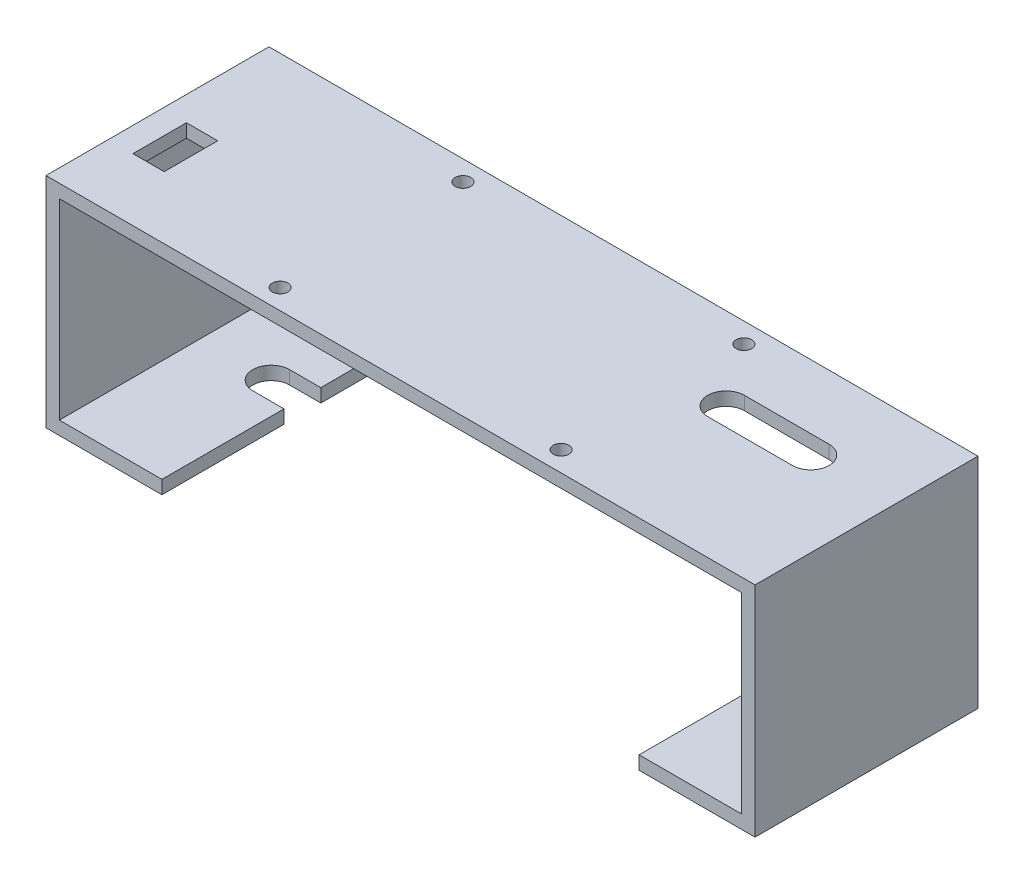
ISO-10303-21;
HEADER;
FILE_DESCRIPTION(('STEP AP214'),'2;1');
FILE_NAME('part.step','',(''),(''),'','','');
FILE_SCHEMA(('AUTOMOTIVE_DESIGN { 1 0 10303 214 1 1 1 1 }'));
ENDSEC;
DATA;
#1=APPLICATION_CONTEXT('core data for automotive mechanical design processes');
#2=APPLICATION_PROTOCOL_DEFINITION('international standard','automotive_design',2000,#1);
#3=PRODUCT_CONTEXT('',#1,'mechanical');
#4=PRODUCT('Part','Part','',(#3));
#5=PRODUCT_RELATED_PRODUCT_CATEGORY('part','',(#4));
#6=PRODUCT_DEFINITION_FORMATION('','',#4);
#7=PRODUCT_DEFINITION_CONTEXT('part definition',#1,'design');
#8=PRODUCT_DEFINITION('design','',#6,#7);
#9=PRODUCT_DEFINITION_SHAPE('','',#8);
#10=(LENGTH_UNIT() NAMED_UNIT(*) SI_UNIT(.MILLI.,.METRE.));
#11=(NAMED_UNIT(*) PLANE_ANGLE_UNIT() SI_UNIT($,.RADIAN.));
#12=(NAMED_UNIT(*) SI_UNIT($,.STERADIAN.) SOLID_ANGLE_UNIT());
#13=UNCERTAINTY_MEASURE_WITH_UNIT(LENGTH_MEASURE(1.E-05),#10,'distance_accuracy_value','');
#14=(GEOMETRIC_REPRESENTATION_CONTEXT(3) GLOBAL_UNCERTAINTY_ASSIGNED_CONTEXT((#13)) GLOBAL_UNIT_ASSIGNED_CONTEXT((#10,
#11,#12)) REPRESENTATION_CONTEXT('',''));
#15=CARTESIAN_POINT('',(0.,0.,0.));
#16=DIRECTION('',(0.,0.,1.));
#17=DIRECTION('',(1.,0.,0.));
#18=AXIS2_PLACEMENT_3D('',#15,#16,#17);
#19=CARTESIAN_POINT('',(0.,0.,0.));
#20=DIRECTION('',(0.,1.,0.));
#21=DIRECTION('',(0.,0.,1.));
#22=AXIS2_PLACEMENT_3D('',#19,#20,#21);
#23=PLANE('',#22);
#24=CARTESIAN_POINT('',(31.5,0.,20.5));
#25=DIRECTION('',(0.,1.,0.));
#26=DIRECTION('',(0.,0.,1.));
#27=AXIS2_PLACEMENT_3D('',#24,#25,#26);
#28=CIRCLE('',#27,1.75);
#29=CARTESIAN_POINT('',(31.5,0.,22.25));
#30=VERTEX_POINT('',#29);
#31=EDGE_CURVE('E611',#30,#30,#28,.T.);
#32=ORIENTED_EDGE('',*,*,#31,.T.);
#33=EDGE_LOOP('',(#32));
#34=FACE_BOUND('',#33,.T.);
#35=CARTESIAN_POINT('',(-31.5,0.,-20.5));
#36=DIRECTION('',(0.,1.,0.));
#37=DIRECTION('',(0.,0.,1.));
#38=AXIS2_PLACEMENT_3D('',#35,#36,#37);
#39=CIRCLE('',#38,1.75);
#40=CARTESIAN_POINT('',(-31.5,0.,-18.75));
#41=VERTEX_POINT('',#40);
#42=EDGE_CURVE('E622',#41,#41,#39,.T.);
#43=ORIENTED_EDGE('',*,*,#42,.T.);
#44=EDGE_LOOP('',(#43));
#45=FACE_BOUND('',#44,.T.);
#46=DIRECTION('',(-1.,0.,0.));
#47=VECTOR('',#46,1.);
#48=CARTESIAN_POINT('',(-74.,0.,11.));
#49=LINE('',#48,#47);
#50=CARTESIAN_POINT('',(-67.,0.,11.));
#51=VERTEX_POINT('',#50);
#52=CARTESIAN_POINT('',(-74.,0.,11.));
#53=VERTEX_POINT('',#52);
#54=EDGE_CURVE('E224',#51,#53,#49,.T.);
#55=ORIENTED_EDGE('',*,*,#54,.F.);
#56=DIRECTION('',(0.,0.,1.));
#57=VECTOR('',#56,1.);
#58=CARTESIAN_POINT('',(-67.,0.,-0.999999999999994));
#59=LINE('',#58,#57);
#60=CARTESIAN_POINT('',(-67.,0.,-0.999999999999994));
#61=VERTEX_POINT('',#60);
#62=EDGE_CURVE('E231',#61,#51,#59,.T.);
#63=ORIENTED_EDGE('',*,*,#62,.F.);
#64=DIRECTION('',(1.,0.,0.));
#65=VECTOR('',#64,1.);
#66=CARTESIAN_POINT('',(-74.,0.,-0.999999999999994));
#67=LINE('',#66,#65);
#68=CARTESIAN_POINT('',(-74.,0.,-0.999999999999994));
#69=VERTEX_POINT('',#68);
#70=EDGE_CURVE('E236',#69,#61,#67,.T.);
#71=ORIENTED_EDGE('',*,*,#70,.F.);
#72=DIRECTION('',(0.,0.,-1.));
#73=VECTOR('',#72,1.);
#74=CARTESIAN_POINT('',(-74.,0.,-0.999999999999994));
#75=LINE('',#74,#73);
#76=EDGE_CURVE('E51',#53,#69,#75,.T.);
#77=ORIENTED_EDGE('',*,*,#76,.F.);
#78=EDGE_LOOP('',(#55,#63,#71,#77));
#79=FACE_BOUND('',#78,.T.);
#80=DIRECTION('',(1.,0.,0.));
#81=VECTOR('',#80,1.);
#82=CARTESIAN_POINT('',(41.5,0.,-10.625));
#83=LINE('',#82,#81);
#84=CARTESIAN_POINT('',(41.5,0.,-10.625));
#85=VERTEX_POINT('',#84);
#86=CARTESIAN_POINT('',(60.5,0.,-10.625));
#87=VERTEX_POINT('',#86);
#88=EDGE_CURVE('E290',#85,#87,#83,.T.);
#89=ORIENTED_EDGE('',*,*,#88,.F.);
#90=CARTESIAN_POINT('',(41.5,0.,-6.49999999999999));
#91=DIRECTION('',(0.,-1.,0.));
#92=DIRECTION('',(0.,0.,-1.));
#93=AXIS2_PLACEMENT_3D('',#90,#91,#92);
#94=CIRCLE('',#93,4.125);
#95=CARTESIAN_POINT('',(41.5,0.,-2.37499999999999));
#96=VERTEX_POINT('',#95);
#97=EDGE_CURVE('E288',#96,#85,#94,.T.);
#98=ORIENTED_EDGE('',*,*,#97,.F.);
#99=DIRECTION('',(-1.,0.,0.));
#100=VECTOR('',#99,1.);
#101=CARTESIAN_POINT('',(41.5,0.,-2.37499999999999));
#102=LINE('',#101,#100);
#103=CARTESIAN_POINT('',(60.5,0.,-2.37499999999999));
#104=VERTEX_POINT('',#103);
#105=EDGE_CURVE('E296',#104,#96,#102,.T.);
#106=ORIENTED_EDGE('',*,*,#105,.F.);
#107=CARTESIAN_POINT('',(60.5,0.,-6.49999999999999));
#108=DIRECTION('',(0.,-1.,0.));
#109=DIRECTION('',(0.,0.,-1.));
#110=AXIS2_PLACEMENT_3D('',#107,#108,#109);
#111=CIRCLE('',#110,4.125);
#112=EDGE_CURVE('E293',#87,#104,#111,.T.);
#113=ORIENTED_EDGE('',*,*,#112,.F.);
#114=EDGE_LOOP('',(#89,#98,#106,#113));
#115=FACE_BOUND('',#114,.T.);
#116=DIRECTION('',(0.,0.,-1.));
#117=VECTOR('',#116,1.);
#118=CARTESIAN_POINT('',(76.5,0.,77.8393792544916));
#119=LINE('',#118,#117);
#120=CARTESIAN_POINT('',(76.5,0.,25.));
#121=VERTEX_POINT('',#120);
#122=CARTESIAN_POINT('',(76.5,0.,-25.));
#123=VERTEX_POINT('',#122);
#124=EDGE_CURVE('E342',#121,#123,#119,.T.);
#125=ORIENTED_EDGE('',*,*,#124,.F.);
#126=DIRECTION('',(1.,0.,0.));
#127=VECTOR('',#126,1.);
#128=CARTESIAN_POINT('',(-52.5,0.,25.));
#129=LINE('',#128,#127);
#130=CARTESIAN_POINT('',(-76.5,0.,25.));
#131=VERTEX_POINT('',#130);
#132=EDGE_CURVE('E417',#131,#121,#129,.T.);
#133=ORIENTED_EDGE('',*,*,#132,.F.);
#134=DIRECTION('',(0.,0.,-1.));
#135=VECTOR('',#134,1.);
#136=CARTESIAN_POINT('',(-76.5,0.,77.8393792544916));
#137=LINE('',#136,#135);
#138=CARTESIAN_POINT('',(-76.5,0.,-25.));
#139=VERTEX_POINT('',#138);
#140=EDGE_CURVE('E389',#131,#139,#137,.T.);
#141=ORIENTED_EDGE('',*,*,#140,.T.);
#142=DIRECTION('',(-1.,0.,0.));
#143=VECTOR('',#142,1.);
#144=CARTESIAN_POINT('',(-79.5,0.,-25.));
#145=LINE('',#144,#143);
#146=EDGE_CURVE('E37',#123,#139,#145,.T.);
#147=ORIENTED_EDGE('',*,*,#146,.F.);
#148=EDGE_LOOP('',(#125,#133,#141,#147));
#149=FACE_BOUND('',#148,.T.);
#150=CARTESIAN_POINT('',(-31.5,0.,20.5));
#151=DIRECTION('',(0.,1.,0.));
#152=DIRECTION('',(0.,0.,1.));
#153=AXIS2_PLACEMENT_3D('',#150,#151,#152);
#154=CIRCLE('',#153,1.75);
#155=CARTESIAN_POINT('',(-31.5,0.,22.25));
#156=VERTEX_POINT('',#155);
#157=EDGE_CURVE('E619',#156,#156,#154,.T.);
#158=ORIENTED_EDGE('',*,*,#157,.T.);
#159=EDGE_LOOP('',(#158));
#160=FACE_BOUND('',#159,.T.);
#161=CARTESIAN_POINT('',(31.5,0.,-20.5));
#162=DIRECTION('',(0.,1.,0.));
#163=DIRECTION('',(0.,0.,1.));
#164=AXIS2_PLACEMENT_3D('',#161,#162,#163);
#165=CIRCLE('',#164,1.75);
#166=CARTESIAN_POINT('',(31.5,0.,-18.75));
#167=VERTEX_POINT('',#166);
#168=EDGE_CURVE('E606',#167,#167,#165,.T.);
#169=ORIENTED_EDGE('',*,*,#168,.T.);
#170=EDGE_LOOP('',(#169));
#171=FACE_BOUND('',#170,.T.);
#172=ADVANCED_FACE('F33',(#34,#45,#79,#115,#149,#160,#171),#23,.F.);
#173=CARTESIAN_POINT('',(0.,3.,0.));
#174=DIRECTION('',(0.,1.,0.));
#175=DIRECTION('',(0.,0.,1.));
#176=AXIS2_PLACEMENT_3D('',#173,#174,#175);
#177=PLANE('',#176);
#178=CARTESIAN_POINT('',(31.5,3.,20.5));
#179=DIRECTION('',(0.,1.,0.));
#180=DIRECTION('',(0.,0.,1.));
#181=AXIS2_PLACEMENT_3D('',#178,#179,#180);
#182=CIRCLE('',#181,1.75);
#183=CARTESIAN_POINT('',(31.5,3.,22.25));
#184=VERTEX_POINT('',#183);
#185=EDGE_CURVE('E608',#184,#184,#182,.T.);
#186=ORIENTED_EDGE('',*,*,#185,.F.);
#187=EDGE_LOOP('',(#186));
#188=FACE_BOUND('',#187,.T.);
#189=CARTESIAN_POINT('',(-31.5,3.,-20.5));
#190=DIRECTION('',(0.,1.,0.));
#191=DIRECTION('',(0.,0.,1.));
#192=AXIS2_PLACEMENT_3D('',#189,#190,#191);
#193=CIRCLE('',#192,1.75);
#194=CARTESIAN_POINT('',(-31.5,3.,-18.75));
#195=VERTEX_POINT('',#194);
#196=EDGE_CURVE('E248',#195,#195,#193,.T.);
#197=ORIENTED_EDGE('',*,*,#196,.F.);
#198=EDGE_LOOP('',(#197));
#199=FACE_BOUND('',#198,.T.);
#200=DIRECTION('',(0.,0.,-1.));
#201=VECTOR('',#200,1.);
#202=CARTESIAN_POINT('',(-67.,3.,-0.999999999999994));
#203=LINE('',#202,#201);
#204=CARTESIAN_POINT('',(-67.,3.,11.));
#205=VERTEX_POINT('',#204);
#206=CARTESIAN_POINT('',(-67.,3.,-0.999999999999994));
#207=VERTEX_POINT('',#206);
#208=EDGE_CURVE('E59',#205,#207,#203,.T.);
#209=ORIENTED_EDGE('',*,*,#208,.F.);
#210=DIRECTION('',(1.,0.,0.));
#211=VECTOR('',#210,1.);
#212=CARTESIAN_POINT('',(-74.,3.,11.));
#213=LINE('',#212,#211);
#214=CARTESIAN_POINT('',(-74.,3.,11.));
#215=VERTEX_POINT('',#214);
#216=EDGE_CURVE('E226',#215,#205,#213,.T.);
#217=ORIENTED_EDGE('',*,*,#216,.F.);
#218=DIRECTION('',(0.,0.,1.));
#219=VECTOR('',#218,1.);
#220=CARTESIAN_POINT('',(-74.,3.,-0.999999999999994));
#221=LINE('',#220,#219);
#222=CARTESIAN_POINT('',(-74.,3.,-0.999999999999994));
#223=VERTEX_POINT('',#222);
#224=EDGE_CURVE('E629',#223,#215,#221,.T.);
#225=ORIENTED_EDGE('',*,*,#224,.F.);
#226=DIRECTION('',(-1.,0.,0.));
#227=VECTOR('',#226,1.);
#228=CARTESIAN_POINT('',(-74.,3.,-0.999999999999994));
#229=LINE('',#228,#227);
#230=EDGE_CURVE('E632',#207,#223,#229,.T.);
#231=ORIENTED_EDGE('',*,*,#230,.F.);
#232=EDGE_LOOP('',(#209,#217,#225,#231));
#233=FACE_BOUND('',#232,.T.);
#234=CARTESIAN_POINT('',(41.5,3.,-6.49999999999999));
#235=DIRECTION('',(0.,1.,0.));
#236=DIRECTION('',(0.,0.,1.));
#237=AXIS2_PLACEMENT_3D('',#234,#235,#236);
#238=CIRCLE('',#237,4.125);
#239=CARTESIAN_POINT('',(41.5,3.,-2.37499999999999));
#240=VERTEX_POINT('',#239);
#241=CARTESIAN_POINT('',(41.5,3.,-10.625));
#242=VERTEX_POINT('',#241);
#243=EDGE_CURVE('E285',#240,#242,#238,.F.);
#244=ORIENTED_EDGE('',*,*,#243,.T.);
#245=DIRECTION('',(1.,0.,0.));
#246=VECTOR('',#245,1.);
#247=CARTESIAN_POINT('',(41.5,3.,-10.625));
#248=LINE('',#247,#246);
#249=CARTESIAN_POINT('',(60.5,3.,-10.625));
#250=VERTEX_POINT('',#249);
#251=EDGE_CURVE('E302',#242,#250,#248,.T.);
#252=ORIENTED_EDGE('',*,*,#251,.T.);
#253=CARTESIAN_POINT('',(60.5,3.,-6.49999999999999));
#254=DIRECTION('',(0.,1.,0.));
#255=DIRECTION('',(0.,0.,1.));
#256=AXIS2_PLACEMENT_3D('',#253,#254,#255);
#257=CIRCLE('',#256,4.125);
#258=CARTESIAN_POINT('',(60.5,3.,-2.375));
#259=VERTEX_POINT('',#258);
#260=EDGE_CURVE('E279',#250,#259,#257,.F.);
#261=ORIENTED_EDGE('',*,*,#260,.T.);
#262=DIRECTION('',(-1.,0.,0.));
#263=VECTOR('',#262,1.);
#264=CARTESIAN_POINT('',(41.5,3.,-2.37499999999999));
#265=LINE('',#264,#263);
#266=EDGE_CURVE('E282',#259,#240,#265,.T.);
#267=ORIENTED_EDGE('',*,*,#266,.T.);
#268=EDGE_LOOP('',(#244,#252,#261,#267));
#269=FACE_BOUND('',#268,.T.);
#270=DIRECTION('',(1.,0.,0.));
#271=VECTOR('',#270,1.);
#272=CARTESIAN_POINT('',(52.5,3.,25.));
#273=LINE('',#272,#271);
#274=CARTESIAN_POINT('',(-79.5,3.,25.));
#275=VERTEX_POINT('',#274);
#276=CARTESIAN_POINT('',(79.5,3.,25.));
#277=VERTEX_POINT('',#276);
#278=EDGE_CURVE('E404',#275,#277,#273,.T.);
#279=ORIENTED_EDGE('',*,*,#278,.T.);
#280=DIRECTION('',(0.,0.,-1.));
#281=VECTOR('',#280,1.);
#282=CARTESIAN_POINT('',(79.5,3.,25.));
#283=LINE('',#282,#281);
#284=CARTESIAN_POINT('',(79.5,3.,-25.));
#285=VERTEX_POINT('',#284);
#286=EDGE_CURVE('E425',#277,#285,#283,.T.);
#287=ORIENTED_EDGE('',*,*,#286,.T.);
#288=DIRECTION('',(-1.,0.,0.));
#289=VECTOR('',#288,1.);
#290=CARTESIAN_POINT('',(79.5,3.,-25.));
#291=LINE('',#290,#289);
#292=CARTESIAN_POINT('',(-79.5,3.,-25.));
#293=VERTEX_POINT('',#292);
#294=EDGE_CURVE('E442',#285,#293,#291,.T.);
#295=ORIENTED_EDGE('',*,*,#294,.T.);
#296=DIRECTION('',(0.,0.,1.));
#297=VECTOR('',#296,1.);
#298=CARTESIAN_POINT('',(-79.5,3.,25.));
#299=LINE('',#298,#297);
#300=EDGE_CURVE('E435',#293,#275,#299,.T.);
#301=ORIENTED_EDGE('',*,*,#300,.T.);
#302=EDGE_LOOP('',(#279,#287,#295,#301));
#303=FACE_BOUND('',#302,.T.);
#304=CARTESIAN_POINT('',(-31.5,3.,20.5));
#305=DIRECTION('',(0.,1.,0.));
#306=DIRECTION('',(0.,0.,1.));
#307=AXIS2_PLACEMENT_3D('',#304,#305,#306);
#308=CIRCLE('',#307,1.75);
#309=CARTESIAN_POINT('',(-31.5,3.,22.25));
#310=VERTEX_POINT('',#309);
#311=EDGE_CURVE('E616',#310,#310,#308,.T.);
#312=ORIENTED_EDGE('',*,*,#311,.F.);
#313=EDGE_LOOP('',(#312));
#314=FACE_BOUND('',#313,.T.);
#315=CARTESIAN_POINT('',(31.5,3.,-20.5));
#316=DIRECTION('',(0.,1.,0.));
#317=DIRECTION('',(0.,0.,1.));
#318=AXIS2_PLACEMENT_3D('',#315,#316,#317);
#319=CIRCLE('',#318,1.75);
#320=CARTESIAN_POINT('',(31.5,3.,-18.75));
#321=VERTEX_POINT('',#320);
#322=EDGE_CURVE('E603',#321,#321,#319,.T.);
#323=ORIENTED_EDGE('',*,*,#322,.F.);
#324=EDGE_LOOP('',(#323));
#325=FACE_BOUND('',#324,.T.);
#326=ADVANCED_FACE('F489',(#188,#199,#233,#269,#303,#314,#325),#177,.T.);
#327=CARTESIAN_POINT('',(-53.5,-46.,77.8393792544916));
#328=DIRECTION('',(1.,0.,0.));
#329=DIRECTION('',(0.,0.,-1.));
#330=AXIS2_PLACEMENT_3D('',#327,#328,#329);
#331=PLANE('',#330);
#332=DIRECTION('',(0.,-1.,0.));
#333=VECTOR('',#332,1.);
#334=CARTESIAN_POINT('',(-53.5,3.001,-2.37499999999999));
#335=LINE('',#334,#333);
#336=CARTESIAN_POINT('',(-53.5,-43.,-2.37499999999999));
#337=VERTEX_POINT('',#336);
#338=CARTESIAN_POINT('',(-53.5,-46.,-2.37499999999999));
#339=VERTEX_POINT('',#338);
#340=EDGE_CURVE('E325',#337,#339,#335,.T.);
#341=ORIENTED_EDGE('',*,*,#340,.F.);
#342=DIRECTION('',(0.,0.,-1.));
#343=VECTOR('',#342,1.);
#344=CARTESIAN_POINT('',(-53.5,-43.,77.8393792544916));
#345=LINE('',#344,#343);
#346=CARTESIAN_POINT('',(-53.5,-43.,25.));
#347=VERTEX_POINT('',#346);
#348=EDGE_CURVE('E396',#347,#337,#345,.T.);
#349=ORIENTED_EDGE('',*,*,#348,.F.);
#350=DIRECTION('',(0.,1.,0.));
#351=VECTOR('',#350,1.);
#352=CARTESIAN_POINT('',(-53.5,-46.,25.));
#353=LINE('',#352,#351);
#354=CARTESIAN_POINT('',(-53.5,-46.,25.));
#355=VERTEX_POINT('',#354);
#356=EDGE_CURVE('E374',#355,#347,#353,.T.);
#357=ORIENTED_EDGE('',*,*,#356,.F.);
#358=DIRECTION('',(0.,0.,-1.));
#359=VECTOR('',#358,1.);
#360=CARTESIAN_POINT('',(-53.5,-46.,77.8393792544916));
#361=LINE('',#360,#359);
#362=EDGE_CURVE('E392',#355,#339,#361,.T.);
#363=ORIENTED_EDGE('',*,*,#362,.T.);
#364=EDGE_LOOP('',(#341,#349,#357,#363));
#365=FACE_BOUND('',#364,.T.);
#366=ADVANCED_FACE('F506',(#365),#331,.T.);
#367=CARTESIAN_POINT('',(79.5,3.,25.));
#368=DIRECTION('',(-1.,0.,0.));
#369=DIRECTION('',(0.,0.,1.));
#370=AXIS2_PLACEMENT_3D('',#367,#368,#369);
#371=PLANE('',#370);
#372=DIRECTION('',(0.,-1.,0.));
#373=VECTOR('',#372,1.);
#374=CARTESIAN_POINT('',(79.5,3.,25.));
#375=LINE('',#374,#373);
#376=CARTESIAN_POINT('',(79.5,-46.,25.));
#377=VERTEX_POINT('',#376);
#378=EDGE_CURVE('E11',#277,#377,#375,.T.);
#379=ORIENTED_EDGE('',*,*,#378,.T.);
#380=DIRECTION('',(0.,0.,-1.));
#381=VECTOR('',#380,1.);
#382=CARTESIAN_POINT('',(79.5,-46.,77.8393792544916));
#383=LINE('',#382,#381);
#384=CARTESIAN_POINT('',(79.5,-46.,-25.));
#385=VERTEX_POINT('',#384);
#386=EDGE_CURVE('E362',#377,#385,#383,.T.);
#387=ORIENTED_EDGE('',*,*,#386,.T.);
#388=DIRECTION('',(0.,-1.,0.));
#389=VECTOR('',#388,1.);
#390=CARTESIAN_POINT('',(79.5,3.,-25.));
#391=LINE('',#390,#389);
#392=EDGE_CURVE('E43',#285,#385,#391,.T.);
#393=ORIENTED_EDGE('',*,*,#392,.F.);
#394=ORIENTED_EDGE('',*,*,#286,.F.);
#395=EDGE_LOOP('',(#379,#387,#393,#394));
#396=FACE_BOUND('',#395,.T.);
#397=ADVANCED_FACE('F35',(#396),#371,.F.);
#398=CARTESIAN_POINT('',(-79.5,3.,-25.));
#399=DIRECTION('',(0.,0.,1.));
#400=DIRECTION('',(1.,0.,0.));
#401=AXIS2_PLACEMENT_3D('',#398,#399,#400);
#402=PLANE('',#401);
#403=ORIENTED_EDGE('',*,*,#392,.T.);
#404=DIRECTION('',(1.,0.,0.));
#405=VECTOR('',#404,1.);
#406=CARTESIAN_POINT('',(79.5,-46.,-25.));
#407=LINE('',#406,#405);
#408=CARTESIAN_POINT('',(53.5,-46.,-25.));
#409=VERTEX_POINT('',#408);
#410=EDGE_CURVE('E337',#409,#385,#407,.T.);
#411=ORIENTED_EDGE('',*,*,#410,.F.);
#412=DIRECTION('',(0.,-1.,0.));
#413=VECTOR('',#412,1.);
#414=CARTESIAN_POINT('',(53.5,-46.,-25.));
#415=LINE('',#414,#413);
#416=CARTESIAN_POINT('',(53.5,-43.,-25.));
#417=VERTEX_POINT('',#416);
#418=EDGE_CURVE('E353',#417,#409,#415,.T.);
#419=ORIENTED_EDGE('',*,*,#418,.F.);
#420=DIRECTION('',(-1.,0.,0.));
#421=VECTOR('',#420,1.);
#422=CARTESIAN_POINT('',(53.5,-43.,-25.));
#423=LINE('',#422,#421);
#424=CARTESIAN_POINT('',(76.5,-43.,-25.));
#425=VERTEX_POINT('',#424);
#426=EDGE_CURVE('E356',#425,#417,#423,.T.);
#427=ORIENTED_EDGE('',*,*,#426,.F.);
#428=DIRECTION('',(0.,-1.,0.));
#429=VECTOR('',#428,1.);
#430=CARTESIAN_POINT('',(76.5,-43.,-25.));
#431=LINE('',#430,#429);
#432=EDGE_CURVE('E359',#123,#425,#431,.T.);
#433=ORIENTED_EDGE('',*,*,#432,.F.);
#434=ORIENTED_EDGE('',*,*,#146,.T.);
#435=DIRECTION('',(0.,-1.,0.));
#436=VECTOR('',#435,1.);
#437=CARTESIAN_POINT('',(-76.5,-43.,-25.));
#438=LINE('',#437,#436);
#439=CARTESIAN_POINT('',(-76.5,-43.,-25.));
#440=VERTEX_POINT('',#439);
#441=EDGE_CURVE('E350',#139,#440,#438,.T.);
#442=ORIENTED_EDGE('',*,*,#441,.T.);
#443=DIRECTION('',(1.,0.,0.));
#444=VECTOR('',#443,1.);
#445=CARTESIAN_POINT('',(-53.5,-43.,-25.));
#446=LINE('',#445,#444);
#447=CARTESIAN_POINT('',(-53.5,-43.,-25.));
#448=VERTEX_POINT('',#447);
#449=EDGE_CURVE('E380',#440,#448,#446,.T.);
#450=ORIENTED_EDGE('',*,*,#449,.T.);
#451=DIRECTION('',(0.,-1.,0.));
#452=VECTOR('',#451,1.);
#453=CARTESIAN_POINT('',(-53.5,-46.,-25.));
#454=LINE('',#453,#452);
#455=CARTESIAN_POINT('',(-53.5,-46.,-25.));
#456=VERTEX_POINT('',#455);
#457=EDGE_CURVE('E383',#448,#456,#454,.T.);
#458=ORIENTED_EDGE('',*,*,#457,.T.);
#459=DIRECTION('',(-1.,0.,0.));
#460=VECTOR('',#459,1.);
#461=CARTESIAN_POINT('',(-79.5,-46.,-25.));
#462=LINE('',#461,#460);
#463=CARTESIAN_POINT('',(-79.5,-46.,-25.));
#464=VERTEX_POINT('',#463);
#465=EDGE_CURVE('E386',#456,#464,#462,.T.);
#466=ORIENTED_EDGE('',*,*,#465,.T.);
#467=DIRECTION('',(0.,-1.,0.));
#468=VECTOR('',#467,1.);
#469=CARTESIAN_POINT('',(-79.5,3.,-25.));
#470=LINE('',#469,#468);
#471=EDGE_CURVE('E434',#293,#464,#470,.T.);
#472=ORIENTED_EDGE('',*,*,#471,.F.);
#473=ORIENTED_EDGE('',*,*,#294,.F.);
#474=EDGE_LOOP('',(#403,#411,#419,#427,#433,#434,#442,#450,#458,#466,#472,#473));
#475=FACE_BOUND('',#474,.T.);
#476=ADVANCED_FACE('F439',(#475),#402,.F.);
#477=CARTESIAN_POINT('',(-79.5,3.,25.));
#478=DIRECTION('',(1.,0.,0.));
#479=DIRECTION('',(0.,0.,-1.));
#480=AXIS2_PLACEMENT_3D('',#477,#478,#479);
#481=PLANE('',#480);
#482=ORIENTED_EDGE('',*,*,#471,.T.);
#483=DIRECTION('',(0.,0.,-1.));
#484=VECTOR('',#483,1.);
#485=CARTESIAN_POINT('',(-79.5,-46.,77.8393792544916));
#486=LINE('',#485,#484);
#487=CARTESIAN_POINT('',(-79.5,-46.,25.));
#488=VERTEX_POINT('',#487);
#489=EDGE_CURVE('E375',#488,#464,#486,.T.);
#490=ORIENTED_EDGE('',*,*,#489,.F.);
#491=DIRECTION('',(0.,-1.,0.));
#492=VECTOR('',#491,1.);
#493=CARTESIAN_POINT('',(-79.5,3.,25.));
#494=LINE('',#493,#492);
#495=EDGE_CURVE('E432',#275,#488,#494,.T.);
#496=ORIENTED_EDGE('',*,*,#495,.F.);
#497=ORIENTED_EDGE('',*,*,#300,.F.);
#498=EDGE_LOOP('',(#482,#490,#496,#497));
#499=FACE_BOUND('',#498,.T.);
#500=ADVANCED_FACE('F486',(#499),#481,.F.);
#501=CARTESIAN_POINT('',(-52.5,3.,25.));
#502=DIRECTION('',(0.,0.,-1.));
#503=DIRECTION('',(-1.,0.,0.));
#504=AXIS2_PLACEMENT_3D('',#501,#502,#503);
#505=PLANE('',#504);
#506=ORIENTED_EDGE('',*,*,#495,.T.);
#507=DIRECTION('',(1.,0.,0.));
#508=VECTOR('',#507,1.);
#509=CARTESIAN_POINT('',(-79.5,-46.,25.));
#510=LINE('',#509,#508);
#511=EDGE_CURVE('E377',#488,#355,#510,.T.);
#512=ORIENTED_EDGE('',*,*,#511,.T.);
#513=ORIENTED_EDGE('',*,*,#356,.T.);
#514=DIRECTION('',(-1.,0.,0.));
#515=VECTOR('',#514,1.);
#516=CARTESIAN_POINT('',(-53.5,-43.,25.));
#517=LINE('',#516,#515);
#518=CARTESIAN_POINT('',(-76.5,-43.,25.));
#519=VERTEX_POINT('',#518);
#520=EDGE_CURVE('E372',#347,#519,#517,.T.);
#521=ORIENTED_EDGE('',*,*,#520,.T.);
#522=DIRECTION('',(0.,1.,0.));
#523=VECTOR('',#522,1.);
#524=CARTESIAN_POINT('',(-76.5,-43.,25.));
#525=LINE('',#524,#523);
#526=EDGE_CURVE('E379',#519,#131,#525,.T.);
#527=ORIENTED_EDGE('',*,*,#526,.T.);
#528=ORIENTED_EDGE('',*,*,#132,.T.);
#529=DIRECTION('',(0.,1.,0.));
#530=VECTOR('',#529,1.);
#531=CARTESIAN_POINT('',(76.5,-43.,25.));
#532=LINE('',#531,#530);
#533=CARTESIAN_POINT('',(76.5,-43.,25.));
#534=VERTEX_POINT('',#533);
#535=EDGE_CURVE('E348',#534,#121,#532,.T.);
#536=ORIENTED_EDGE('',*,*,#535,.F.);
#537=DIRECTION('',(1.,0.,0.));
#538=VECTOR('',#537,1.);
#539=CARTESIAN_POINT('',(53.5,-43.,25.));
#540=LINE('',#539,#538);
#541=CARTESIAN_POINT('',(53.5,-43.,25.));
#542=VERTEX_POINT('',#541);
#543=EDGE_CURVE('E345',#542,#534,#540,.T.);
#544=ORIENTED_EDGE('',*,*,#543,.F.);
#545=DIRECTION('',(0.,1.,0.));
#546=VECTOR('',#545,1.);
#547=CARTESIAN_POINT('',(53.5,-46.,25.));
#548=LINE('',#547,#546);
#549=CARTESIAN_POINT('',(53.5,-46.,25.));
#550=VERTEX_POINT('',#549);
#551=EDGE_CURVE('E341',#550,#542,#548,.T.);
#552=ORIENTED_EDGE('',*,*,#551,.F.);
#553=DIRECTION('',(-1.,0.,0.));
#554=VECTOR('',#553,1.);
#555=CARTESIAN_POINT('',(79.5,-46.,25.));
#556=LINE('',#555,#554);
#557=EDGE_CURVE('E338',#377,#550,#556,.T.);
#558=ORIENTED_EDGE('',*,*,#557,.F.);
#559=ORIENTED_EDGE('',*,*,#378,.F.);
#560=ORIENTED_EDGE('',*,*,#278,.F.);
#561=EDGE_LOOP('',(#506,#512,#513,#521,#527,#528,#536,#544,#552,#558,#559,#560));
#562=FACE_BOUND('',#561,.T.);
#563=ADVANCED_FACE('F491',(#562),#505,.F.);
#564=CARTESIAN_POINT('',(-79.5,-46.,77.8393792544916));
#565=DIRECTION('',(0.,-1.,0.));
#566=DIRECTION('',(0.,0.,-1.));
#567=AXIS2_PLACEMENT_3D('',#564,#565,#566);
#568=PLANE('',#567);
#569=DIRECTION('',(-1.,0.,0.));
#570=VECTOR('',#569,1.);
#571=CARTESIAN_POINT('',(-53.5,-46.,-2.37499999999999));
#572=LINE('',#571,#570);
#573=CARTESIAN_POINT('',(-60.5,-46.,-2.37499999999999));
#574=VERTEX_POINT('',#573);
#575=EDGE_CURVE('E317',#339,#574,#572,.T.);
#576=ORIENTED_EDGE('',*,*,#575,.F.);
#577=ORIENTED_EDGE('',*,*,#362,.F.);
#578=ORIENTED_EDGE('',*,*,#511,.F.);
#579=ORIENTED_EDGE('',*,*,#489,.T.);
#580=ORIENTED_EDGE('',*,*,#465,.F.);
#581=CARTESIAN_POINT('',(-53.5,-46.,-10.625));
#582=VERTEX_POINT('',#581);
#583=EDGE_CURVE('E395',#582,#456,#361,.T.);
#584=ORIENTED_EDGE('',*,*,#583,.F.);
#585=DIRECTION('',(1.,0.,0.));
#586=VECTOR('',#585,1.);
#587=CARTESIAN_POINT('',(-60.5,-46.,-10.625));
#588=LINE('',#587,#586);
#589=CARTESIAN_POINT('',(-60.5,-46.,-10.625));
#590=VERTEX_POINT('',#589);
#591=EDGE_CURVE('E323',#590,#582,#588,.T.);
#592=ORIENTED_EDGE('',*,*,#591,.F.);
#593=CARTESIAN_POINT('',(-60.5,-46.,-6.49999999999999));
#594=DIRECTION('',(0.,-1.,0.));
#595=DIRECTION('',(0.,0.,-1.));
#596=AXIS2_PLACEMENT_3D('',#593,#594,#595);
#597=CIRCLE('',#596,4.125);
#598=EDGE_CURVE('E320',#574,#590,#597,.T.);
#599=ORIENTED_EDGE('',*,*,#598,.F.);
#600=EDGE_LOOP('',(#576,#577,#578,#579,#580,#584,#592,#599));
#601=FACE_BOUND('',#600,.T.);
#602=ADVANCED_FACE('F479',(#601),#568,.T.);
#603=DIRECTION('',(0.,-1.,0.));
#604=VECTOR('',#603,1.);
#605=CARTESIAN_POINT('',(-53.5,3.001,-10.625));
#606=LINE('',#605,#604);
#607=CARTESIAN_POINT('',(-53.5,-43.,-10.625));
#608=VERTEX_POINT('',#607);
#609=EDGE_CURVE('E326',#608,#582,#606,.T.);
#610=ORIENTED_EDGE('',*,*,#609,.T.);
#611=ORIENTED_EDGE('',*,*,#583,.T.);
#612=ORIENTED_EDGE('',*,*,#457,.F.);
#613=EDGE_CURVE('E399',#608,#448,#345,.T.);
#614=ORIENTED_EDGE('',*,*,#613,.F.);
#615=EDGE_LOOP('',(#610,#611,#612,#614));
#616=FACE_BOUND('',#615,.T.);
#617=ADVANCED_FACE('F473',(#616),#331,.T.);
#618=CARTESIAN_POINT('',(-53.5,-43.,77.8393792544916));
#619=DIRECTION('',(0.,1.,0.));
#620=DIRECTION('',(0.,0.,1.));
#621=AXIS2_PLACEMENT_3D('',#618,#619,#620);
#622=PLANE('',#621);
#623=DIRECTION('',(-1.,0.,0.));
#624=VECTOR('',#623,1.);
#625=CARTESIAN_POINT('',(-53.5,-43.,-2.37499999999999));
#626=LINE('',#625,#624);
#627=CARTESIAN_POINT('',(-60.5,-43.,-2.37499999999999));
#628=VERTEX_POINT('',#627);
#629=EDGE_CURVE('E329',#337,#628,#626,.T.);
#630=ORIENTED_EDGE('',*,*,#629,.T.);
#631=CARTESIAN_POINT('',(-60.5,-43.,-6.49999999999999));
#632=DIRECTION('',(0.,1.,0.));
#633=DIRECTION('',(0.,0.,1.));
#634=AXIS2_PLACEMENT_3D('',#631,#632,#633);
#635=CIRCLE('',#634,4.125);
#636=CARTESIAN_POINT('',(-60.5,-43.,-10.625));
#637=VERTEX_POINT('',#636);
#638=EDGE_CURVE('E311',#628,#637,#635,.F.);
#639=ORIENTED_EDGE('',*,*,#638,.T.);
#640=DIRECTION('',(1.,0.,0.));
#641=VECTOR('',#640,1.);
#642=CARTESIAN_POINT('',(-60.5,-43.,-10.625));
#643=LINE('',#642,#641);
#644=EDGE_CURVE('E314',#637,#608,#643,.T.);
#645=ORIENTED_EDGE('',*,*,#644,.T.);
#646=ORIENTED_EDGE('',*,*,#613,.T.);
#647=ORIENTED_EDGE('',*,*,#449,.F.);
#648=DIRECTION('',(0.,0.,-1.));
#649=VECTOR('',#648,1.);
#650=CARTESIAN_POINT('',(-76.5,-43.,77.8393792544916));
#651=LINE('',#650,#649);
#652=EDGE_CURVE('E400',#519,#440,#651,.T.);
#653=ORIENTED_EDGE('',*,*,#652,.F.);
#654=ORIENTED_EDGE('',*,*,#520,.F.);
#655=ORIENTED_EDGE('',*,*,#348,.T.);
#656=EDGE_LOOP('',(#630,#639,#645,#646,#647,#653,#654,#655));
#657=FACE_BOUND('',#656,.T.);
#658=ADVANCED_FACE('F469',(#657),#622,.T.);
#659=CARTESIAN_POINT('',(-76.5,-43.,77.8393792544916));
#660=DIRECTION('',(1.,0.,0.));
#661=DIRECTION('',(0.,0.,-1.));
#662=AXIS2_PLACEMENT_3D('',#659,#660,#661);
#663=PLANE('',#662);
#664=ORIENTED_EDGE('',*,*,#526,.F.);
#665=ORIENTED_EDGE('',*,*,#652,.T.);
#666=ORIENTED_EDGE('',*,*,#441,.F.);
#667=ORIENTED_EDGE('',*,*,#140,.F.);
#668=EDGE_LOOP('',(#664,#665,#666,#667));
#669=FACE_BOUND('',#668,.T.);
#670=ADVANCED_FACE('F464',(#669),#663,.T.);
#671=CARTESIAN_POINT('',(79.5,-46.,77.8393792544916));
#672=DIRECTION('',(0.,1.,0.));
#673=DIRECTION('',(0.,0.,1.));
#674=AXIS2_PLACEMENT_3D('',#671,#672,#673);
#675=PLANE('',#674);
#676=DIRECTION('',(0.,0.,-1.));
#677=VECTOR('',#676,1.);
#678=CARTESIAN_POINT('',(67.,-46.,11.));
#679=LINE('',#678,#677);
#680=CARTESIAN_POINT('',(67.,-46.,11.));
#681=VERTEX_POINT('',#680);
#682=CARTESIAN_POINT('',(67.,-46.,-0.99999999999999));
#683=VERTEX_POINT('',#682);
#684=EDGE_CURVE('E263',#681,#683,#679,.T.);
#685=ORIENTED_EDGE('',*,*,#684,.F.);
#686=DIRECTION('',(-1.,0.,0.));
#687=VECTOR('',#686,1.);
#688=CARTESIAN_POINT('',(67.,-46.,11.));
#689=LINE('',#688,#687);
#690=CARTESIAN_POINT('',(74.,-46.,11.));
#691=VERTEX_POINT('',#690);
#692=EDGE_CURVE('E260',#691,#681,#689,.T.);
#693=ORIENTED_EDGE('',*,*,#692,.F.);
#694=DIRECTION('',(0.,0.,1.));
#695=VECTOR('',#694,1.);
#696=CARTESIAN_POINT('',(74.,-46.,11.));
#697=LINE('',#696,#695);
#698=CARTESIAN_POINT('',(74.,-46.,-0.999999999999987));
#699=VERTEX_POINT('',#698);
#700=EDGE_CURVE('E257',#699,#691,#697,.T.);
#701=ORIENTED_EDGE('',*,*,#700,.F.);
#702=DIRECTION('',(1.,0.,0.));
#703=VECTOR('',#702,1.);
#704=CARTESIAN_POINT('',(67.,-46.,-0.99999999999999));
#705=LINE('',#704,#703);
#706=EDGE_CURVE('E266',#683,#699,#705,.T.);
#707=ORIENTED_EDGE('',*,*,#706,.F.);
#708=EDGE_LOOP('',(#685,#693,#701,#707));
#709=FACE_BOUND('',#708,.T.);
#710=ORIENTED_EDGE('',*,*,#386,.F.);
#711=ORIENTED_EDGE('',*,*,#557,.T.);
#712=DIRECTION('',(0.,0.,-1.));
#713=VECTOR('',#712,1.);
#714=CARTESIAN_POINT('',(53.5,-46.,77.8393792544916));
#715=LINE('',#714,#713);
#716=EDGE_CURVE('E368',#550,#409,#715,.T.);
#717=ORIENTED_EDGE('',*,*,#716,.T.);
#718=ORIENTED_EDGE('',*,*,#410,.T.);
#719=EDGE_LOOP('',(#710,#711,#717,#718));
#720=FACE_BOUND('',#719,.T.);
#721=ADVANCED_FACE('F449',(#709,#720),#675,.F.);
#722=CARTESIAN_POINT('',(53.5,-46.,77.8393792544916));
#723=DIRECTION('',(1.,0.,0.));
#724=DIRECTION('',(0.,0.,-1.));
#725=AXIS2_PLACEMENT_3D('',#722,#723,#724);
#726=PLANE('',#725);
#727=ORIENTED_EDGE('',*,*,#716,.F.);
#728=ORIENTED_EDGE('',*,*,#551,.T.);
#729=DIRECTION('',(0.,0.,-1.));
#730=VECTOR('',#729,1.);
#731=CARTESIAN_POINT('',(53.5,-43.,77.8393792544916));
#732=LINE('',#731,#730);
#733=EDGE_CURVE('E366',#542,#417,#732,.T.);
#734=ORIENTED_EDGE('',*,*,#733,.T.);
#735=ORIENTED_EDGE('',*,*,#418,.T.);
#736=EDGE_LOOP('',(#727,#728,#734,#735));
#737=FACE_BOUND('',#736,.T.);
#738=ADVANCED_FACE('F452',(#737),#726,.F.);
#739=CARTESIAN_POINT('',(53.5,-43.,77.8393792544916));
#740=DIRECTION('',(0.,-1.,0.));
#741=DIRECTION('',(0.,0.,-1.));
#742=AXIS2_PLACEMENT_3D('',#739,#740,#741);
#743=PLANE('',#742);
#744=DIRECTION('',(0.,0.,-1.));
#745=VECTOR('',#744,1.);
#746=CARTESIAN_POINT('',(74.,-43.,11.));
#747=LINE('',#746,#745);
#748=CARTESIAN_POINT('',(74.,-43.,11.));
#749=VERTEX_POINT('',#748);
#750=CARTESIAN_POINT('',(74.,-43.,-0.99999999999999));
#751=VERTEX_POINT('',#750);
#752=EDGE_CURVE('E254',#749,#751,#747,.T.);
#753=ORIENTED_EDGE('',*,*,#752,.F.);
#754=DIRECTION('',(1.,0.,0.));
#755=VECTOR('',#754,1.);
#756=CARTESIAN_POINT('',(67.,-43.,11.));
#757=LINE('',#756,#755);
#758=CARTESIAN_POINT('',(67.,-43.,11.));
#759=VERTEX_POINT('',#758);
#760=EDGE_CURVE('E272',#759,#749,#757,.T.);
#761=ORIENTED_EDGE('',*,*,#760,.F.);
#762=DIRECTION('',(0.,0.,1.));
#763=VECTOR('',#762,1.);
#764=CARTESIAN_POINT('',(67.,-43.,11.));
#765=LINE('',#764,#763);
#766=CARTESIAN_POINT('',(67.,-43.,-0.99999999999999));
#767=VERTEX_POINT('',#766);
#768=EDGE_CURVE('E240',#767,#759,#765,.T.);
#769=ORIENTED_EDGE('',*,*,#768,.F.);
#770=DIRECTION('',(-1.,0.,0.));
#771=VECTOR('',#770,1.);
#772=CARTESIAN_POINT('',(67.,-43.,-0.99999999999999));
#773=LINE('',#772,#771);
#774=EDGE_CURVE('E251',#751,#767,#773,.T.);
#775=ORIENTED_EDGE('',*,*,#774,.F.);
#776=EDGE_LOOP('',(#753,#761,#769,#775));
#777=FACE_BOUND('',#776,.T.);
#778=ORIENTED_EDGE('',*,*,#733,.F.);
#779=ORIENTED_EDGE('',*,*,#543,.T.);
#780=DIRECTION('',(0.,0.,-1.));
#781=VECTOR('',#780,1.);
#782=CARTESIAN_POINT('',(76.5,-43.,77.8393792544916));
#783=LINE('',#782,#781);
#784=EDGE_CURVE('E364',#534,#425,#783,.T.);
#785=ORIENTED_EDGE('',*,*,#784,.T.);
#786=ORIENTED_EDGE('',*,*,#426,.T.);
#787=EDGE_LOOP('',(#778,#779,#785,#786));
#788=FACE_BOUND('',#787,.T.);
#789=ADVANCED_FACE('F456',(#777,#788),#743,.F.);
#790=CARTESIAN_POINT('',(76.5,-43.,77.8393792544916));
#791=DIRECTION('',(1.,0.,0.));
#792=DIRECTION('',(0.,0.,-1.));
#793=AXIS2_PLACEMENT_3D('',#790,#791,#792);
#794=PLANE('',#793);
#795=ORIENTED_EDGE('',*,*,#784,.F.);
#796=ORIENTED_EDGE('',*,*,#535,.T.);
#797=ORIENTED_EDGE('',*,*,#124,.T.);
#798=ORIENTED_EDGE('',*,*,#432,.T.);
#799=EDGE_LOOP('',(#795,#796,#797,#798));
#800=FACE_BOUND('',#799,.T.);
#801=ADVANCED_FACE('F459',(#800),#794,.F.);
#802=CARTESIAN_POINT('',(-53.5,3.001,-2.37499999999999));
#803=DIRECTION('',(0.,0.,1.));
#804=DIRECTION('',(1.,0.,0.));
#805=AXIS2_PLACEMENT_3D('',#802,#803,#804);
#806=PLANE('',#805);
#807=ORIENTED_EDGE('',*,*,#340,.T.);
#808=ORIENTED_EDGE('',*,*,#575,.T.);
#809=DIRECTION('',(0.,-1.,0.));
#810=VECTOR('',#809,1.);
#811=CARTESIAN_POINT('',(-60.5,3.001,-2.37499999999999));
#812=LINE('',#811,#810);
#813=EDGE_CURVE('E332',#628,#574,#812,.T.);
#814=ORIENTED_EDGE('',*,*,#813,.F.);
#815=ORIENTED_EDGE('',*,*,#629,.F.);
#816=EDGE_LOOP('',(#807,#808,#814,#815));
#817=FACE_BOUND('',#816,.T.);
#818=ADVANCED_FACE('F528',(#817),#806,.F.);
#819=CARTESIAN_POINT('',(-60.5,3.001,-6.49999999999999));
#820=DIRECTION('',(0.,-1.,0.));
#821=DIRECTION('',(0.,0.,-1.));
#822=AXIS2_PLACEMENT_3D('',#819,#820,#821);
#823=CYLINDRICAL_SURFACE('',#822,4.125);
#824=ORIENTED_EDGE('',*,*,#813,.T.);
#825=ORIENTED_EDGE('',*,*,#598,.T.);
#826=DIRECTION('',(0.,-1.,0.));
#827=VECTOR('',#826,1.);
#828=CARTESIAN_POINT('',(-60.5,3.001,-10.625));
#829=LINE('',#828,#827);
#830=EDGE_CURVE('E330',#637,#590,#829,.T.);
#831=ORIENTED_EDGE('',*,*,#830,.F.);
#832=ORIENTED_EDGE('',*,*,#638,.F.);
#833=EDGE_LOOP('',(#824,#825,#831,#832));
#834=FACE_BOUND('',#833,.T.);
#835=ADVANCED_FACE('F531',(#834),#823,.F.);
#836=CARTESIAN_POINT('',(-60.5,3.001,-10.625));
#837=DIRECTION('',(0.,0.,-1.));
#838=DIRECTION('',(-1.,0.,0.));
#839=AXIS2_PLACEMENT_3D('',#836,#837,#838);
#840=PLANE('',#839);
#841=ORIENTED_EDGE('',*,*,#830,.T.);
#842=ORIENTED_EDGE('',*,*,#591,.T.);
#843=ORIENTED_EDGE('',*,*,#609,.F.);
#844=ORIENTED_EDGE('',*,*,#644,.F.);
#845=EDGE_LOOP('',(#841,#842,#843,#844));
#846=FACE_BOUND('',#845,.T.);
#847=ADVANCED_FACE('F535',(#846),#840,.F.);
#848=CARTESIAN_POINT('',(41.5,3.001,-6.49999999999999));
#849=DIRECTION('',(0.,-1.,0.));
#850=DIRECTION('',(0.,0.,-1.));
#851=AXIS2_PLACEMENT_3D('',#848,#849,#850);
#852=CYLINDRICAL_SURFACE('',#851,4.125);
#853=DIRECTION('',(0.,-1.,0.));
#854=VECTOR('',#853,1.);
#855=CARTESIAN_POINT('',(41.5,3.001,-2.37499999999999));
#856=LINE('',#855,#854);
#857=EDGE_CURVE('E300',#240,#96,#856,.T.);
#858=ORIENTED_EDGE('',*,*,#857,.T.);
#859=ORIENTED_EDGE('',*,*,#97,.T.);
#860=DIRECTION('',(0.,-1.,0.));
#861=VECTOR('',#860,1.);
#862=CARTESIAN_POINT('',(41.5,3.001,-10.625));
#863=LINE('',#862,#861);
#864=EDGE_CURVE('E299',#242,#85,#863,.T.);
#865=ORIENTED_EDGE('',*,*,#864,.F.);
#866=ORIENTED_EDGE('',*,*,#243,.F.);
#867=EDGE_LOOP('',(#858,#859,#865,#866));
#868=FACE_BOUND('',#867,.T.);
#869=ADVANCED_FACE('F539',(#868),#852,.F.);
#870=CARTESIAN_POINT('',(41.5,3.001,-2.37499999999999));
#871=DIRECTION('',(0.,0.,1.));
#872=DIRECTION('',(1.,0.,0.));
#873=AXIS2_PLACEMENT_3D('',#870,#871,#872);
#874=PLANE('',#873);
#875=DIRECTION('',(0.,-1.,0.));
#876=VECTOR('',#875,1.);
#877=CARTESIAN_POINT('',(60.5,3.001,-2.37499999999999));
#878=LINE('',#877,#876);
#879=EDGE_CURVE('E303',#259,#104,#878,.T.);
#880=ORIENTED_EDGE('',*,*,#879,.T.);
#881=ORIENTED_EDGE('',*,*,#105,.T.);
#882=ORIENTED_EDGE('',*,*,#857,.F.);
#883=ORIENTED_EDGE('',*,*,#266,.F.);
#884=EDGE_LOOP('',(#880,#881,#882,#883));
#885=FACE_BOUND('',#884,.T.);
#886=ADVANCED_FACE('F543',(#885),#874,.F.);
#887=CARTESIAN_POINT('',(60.5,3.001,-6.49999999999999));
#888=DIRECTION('',(0.,-1.,0.));
#889=DIRECTION('',(0.,0.,-1.));
#890=AXIS2_PLACEMENT_3D('',#887,#888,#889);
#891=CYLINDRICAL_SURFACE('',#890,4.125);
#892=DIRECTION('',(0.,-1.,0.));
#893=VECTOR('',#892,1.);
#894=CARTESIAN_POINT('',(60.5,3.001,-10.625));
#895=LINE('',#894,#893);
#896=EDGE_CURVE('E305',#250,#87,#895,.T.);
#897=ORIENTED_EDGE('',*,*,#896,.T.);
#898=ORIENTED_EDGE('',*,*,#112,.T.);
#899=ORIENTED_EDGE('',*,*,#879,.F.);
#900=ORIENTED_EDGE('',*,*,#260,.F.);
#901=EDGE_LOOP('',(#897,#898,#899,#900));
#902=FACE_BOUND('',#901,.T.);
#903=ADVANCED_FACE('F549',(#902),#891,.F.);
#904=CARTESIAN_POINT('',(41.5,3.001,-10.625));
#905=DIRECTION('',(0.,0.,-1.));
#906=DIRECTION('',(-1.,0.,0.));
#907=AXIS2_PLACEMENT_3D('',#904,#905,#906);
#908=PLANE('',#907);
#909=ORIENTED_EDGE('',*,*,#864,.T.);
#910=ORIENTED_EDGE('',*,*,#88,.T.);
#911=ORIENTED_EDGE('',*,*,#896,.F.);
#912=ORIENTED_EDGE('',*,*,#251,.F.);
#913=EDGE_LOOP('',(#909,#910,#911,#912));
#914=FACE_BOUND('',#913,.T.);
#915=ADVANCED_FACE('F545',(#914),#908,.F.);
#916=CARTESIAN_POINT('',(67.,3.001,11.));
#917=DIRECTION('',(0.,0.,1.));
#918=DIRECTION('',(1.,0.,0.));
#919=AXIS2_PLACEMENT_3D('',#916,#917,#918);
#920=PLANE('',#919);
#921=ORIENTED_EDGE('',*,*,#760,.T.);
#922=DIRECTION('',(0.,-1.,0.));
#923=VECTOR('',#922,1.);
#924=CARTESIAN_POINT('',(74.,3.001,11.));
#925=LINE('',#924,#923);
#926=EDGE_CURVE('E268',#749,#691,#925,.T.);
#927=ORIENTED_EDGE('',*,*,#926,.T.);
#928=ORIENTED_EDGE('',*,*,#692,.T.);
#929=DIRECTION('',(0.,-1.,0.));
#930=VECTOR('',#929,1.);
#931=CARTESIAN_POINT('',(67.,3.001,11.));
#932=LINE('',#931,#930);
#933=EDGE_CURVE('E275',#759,#681,#932,.T.);
#934=ORIENTED_EDGE('',*,*,#933,.F.);
#935=EDGE_LOOP('',(#921,#927,#928,#934));
#936=FACE_BOUND('',#935,.T.);
#937=ADVANCED_FACE('F548',(#936),#920,.F.);
#938=CARTESIAN_POINT('',(67.,3.001,11.));
#939=DIRECTION('',(-1.,0.,0.));
#940=DIRECTION('',(0.,0.,1.));
#941=AXIS2_PLACEMENT_3D('',#938,#939,#940);
#942=PLANE('',#941);
#943=ORIENTED_EDGE('',*,*,#768,.T.);
#944=ORIENTED_EDGE('',*,*,#933,.T.);
#945=ORIENTED_EDGE('',*,*,#684,.T.);
#946=DIRECTION('',(0.,-1.,0.));
#947=VECTOR('',#946,1.);
#948=CARTESIAN_POINT('',(67.,3.001,-0.99999999999999));
#949=LINE('',#948,#947);
#950=EDGE_CURVE('E273',#767,#683,#949,.T.);
#951=ORIENTED_EDGE('',*,*,#950,.F.);
#952=EDGE_LOOP('',(#943,#944,#945,#951));
#953=FACE_BOUND('',#952,.T.);
#954=ADVANCED_FACE('F564',(#953),#942,.F.);
#955=CARTESIAN_POINT('',(67.,3.001,-0.99999999999999));
#956=DIRECTION('',(0.,0.,-1.));
#957=DIRECTION('',(-1.,0.,0.));
#958=AXIS2_PLACEMENT_3D('',#955,#956,#957);
#959=PLANE('',#958);
#960=ORIENTED_EDGE('',*,*,#774,.T.);
#961=ORIENTED_EDGE('',*,*,#950,.T.);
#962=ORIENTED_EDGE('',*,*,#706,.T.);
#963=DIRECTION('',(0.,-1.,0.));
#964=VECTOR('',#963,1.);
#965=CARTESIAN_POINT('',(74.,3.001,-0.99999999999999));
#966=LINE('',#965,#964);
#967=EDGE_CURVE('E269',#751,#699,#966,.T.);
#968=ORIENTED_EDGE('',*,*,#967,.F.);
#969=EDGE_LOOP('',(#960,#961,#962,#968));
#970=FACE_BOUND('',#969,.T.);
#971=ADVANCED_FACE('F560',(#970),#959,.F.);
#972=CARTESIAN_POINT('',(74.,3.001,11.));
#973=DIRECTION('',(1.,0.,0.));
#974=DIRECTION('',(0.,0.,-1.));
#975=AXIS2_PLACEMENT_3D('',#972,#973,#974);
#976=PLANE('',#975);
#977=ORIENTED_EDGE('',*,*,#752,.T.);
#978=ORIENTED_EDGE('',*,*,#967,.T.);
#979=ORIENTED_EDGE('',*,*,#700,.T.);
#980=ORIENTED_EDGE('',*,*,#926,.F.);
#981=EDGE_LOOP('',(#977,#978,#979,#980));
#982=FACE_BOUND('',#981,.T.);
#983=ADVANCED_FACE('F557',(#982),#976,.F.);
#984=CARTESIAN_POINT('',(-67.,-46.001,-0.999999999999994));
#985=DIRECTION('',(1.,0.,0.));
#986=DIRECTION('',(0.,0.,-1.));
#987=AXIS2_PLACEMENT_3D('',#984,#985,#986);
#988=PLANE('',#987);
#989=ORIENTED_EDGE('',*,*,#62,.T.);
#990=DIRECTION('',(0.,1.,0.));
#991=VECTOR('',#990,1.);
#992=CARTESIAN_POINT('',(-67.,-46.001,11.));
#993=LINE('',#992,#991);
#994=EDGE_CURVE('E220',#51,#205,#993,.T.);
#995=ORIENTED_EDGE('',*,*,#994,.T.);
#996=ORIENTED_EDGE('',*,*,#208,.T.);
#997=DIRECTION('',(0.,1.,0.));
#998=VECTOR('',#997,1.);
#999=CARTESIAN_POINT('',(-67.,-46.001,-0.999999999999994));
#1000=LINE('',#999,#998);
#1001=EDGE_CURVE('E228',#61,#207,#1000,.T.);
#1002=ORIENTED_EDGE('',*,*,#1001,.F.);
#1003=EDGE_LOOP('',(#989,#995,#996,#1002));
#1004=FACE_BOUND('',#1003,.T.);
#1005=ADVANCED_FACE('F232',(#1004),#988,.F.);
#1006=CARTESIAN_POINT('',(-74.,-46.001,11.));
#1007=DIRECTION('',(0.,0.,1.));
#1008=DIRECTION('',(1.,0.,0.));
#1009=AXIS2_PLACEMENT_3D('',#1006,#1007,#1008);
#1010=PLANE('',#1009);
#1011=ORIENTED_EDGE('',*,*,#54,.T.);
#1012=DIRECTION('',(0.,1.,0.));
#1013=VECTOR('',#1012,1.);
#1014=CARTESIAN_POINT('',(-74.,-46.001,11.));
#1015=LINE('',#1014,#1013);
#1016=EDGE_CURVE('E227',#53,#215,#1015,.T.);
#1017=ORIENTED_EDGE('',*,*,#1016,.T.);
#1018=ORIENTED_EDGE('',*,*,#216,.T.);
#1019=ORIENTED_EDGE('',*,*,#994,.F.);
#1020=EDGE_LOOP('',(#1011,#1017,#1018,#1019));
#1021=FACE_BOUND('',#1020,.T.);
#1022=ADVANCED_FACE('F222',(#1021),#1010,.F.);
#1023=CARTESIAN_POINT('',(-74.,-46.001,-0.999999999999994));
#1024=DIRECTION('',(-1.,0.,0.));
#1025=DIRECTION('',(0.,0.,1.));
#1026=AXIS2_PLACEMENT_3D('',#1023,#1024,#1025);
#1027=PLANE('',#1026);
#1028=ORIENTED_EDGE('',*,*,#76,.T.);
#1029=DIRECTION('',(0.,1.,0.));
#1030=VECTOR('',#1029,1.);
#1031=CARTESIAN_POINT('',(-74.,-46.001,-0.999999999999994));
#1032=LINE('',#1031,#1030);
#1033=EDGE_CURVE('E245',#69,#223,#1032,.T.);
#1034=ORIENTED_EDGE('',*,*,#1033,.T.);
#1035=ORIENTED_EDGE('',*,*,#224,.T.);
#1036=ORIENTED_EDGE('',*,*,#1016,.F.);
#1037=EDGE_LOOP('',(#1028,#1034,#1035,#1036));
#1038=FACE_BOUND('',#1037,.T.);
#1039=ADVANCED_FACE('F576',(#1038),#1027,.F.);
#1040=CARTESIAN_POINT('',(-74.,-46.001,-0.999999999999994));
#1041=DIRECTION('',(0.,0.,-1.));
#1042=DIRECTION('',(-1.,0.,0.));
#1043=AXIS2_PLACEMENT_3D('',#1040,#1041,#1042);
#1044=PLANE('',#1043);
#1045=ORIENTED_EDGE('',*,*,#70,.T.);
#1046=ORIENTED_EDGE('',*,*,#1001,.T.);
#1047=ORIENTED_EDGE('',*,*,#230,.T.);
#1048=ORIENTED_EDGE('',*,*,#1033,.F.);
#1049=EDGE_LOOP('',(#1045,#1046,#1047,#1048));
#1050=FACE_BOUND('',#1049,.T.);
#1051=ADVANCED_FACE('F579',(#1050),#1044,.F.);
#1052=CARTESIAN_POINT('',(-31.5,3.001,-20.5));
#1053=DIRECTION('',(0.,-1.,0.));
#1054=DIRECTION('',(0.,0.,-1.));
#1055=AXIS2_PLACEMENT_3D('',#1052,#1053,#1054);
#1056=CYLINDRICAL_SURFACE('',#1055,1.75);
#1057=ORIENTED_EDGE('',*,*,#196,.T.);
#1058=EDGE_LOOP('',(#1057));
#1059=FACE_BOUND('',#1058,.T.);
#1060=ORIENTED_EDGE('',*,*,#42,.F.);
#1061=EDGE_LOOP('',(#1060));
#1062=FACE_BOUND('',#1061,.T.);
#1063=ADVANCED_FACE('F582',(#1059,#1062),#1056,.F.);
#1064=CARTESIAN_POINT('',(-31.5,3.001,20.5));
#1065=DIRECTION('',(0.,-1.,0.));
#1066=DIRECTION('',(0.,0.,-1.));
#1067=AXIS2_PLACEMENT_3D('',#1064,#1065,#1066);
#1068=CYLINDRICAL_SURFACE('',#1067,1.75);
#1069=ORIENTED_EDGE('',*,*,#311,.T.);
#1070=EDGE_LOOP('',(#1069));
#1071=FACE_BOUND('',#1070,.T.);
#1072=ORIENTED_EDGE('',*,*,#157,.F.);
#1073=EDGE_LOOP('',(#1072));
#1074=FACE_BOUND('',#1073,.T.);
#1075=ADVANCED_FACE('F586',(#1071,#1074),#1068,.F.);
#1076=CARTESIAN_POINT('',(31.5,3.001,20.5));
#1077=DIRECTION('',(0.,-1.,0.));
#1078=DIRECTION('',(0.,0.,-1.));
#1079=AXIS2_PLACEMENT_3D('',#1076,#1077,#1078);
#1080=CYLINDRICAL_SURFACE('',#1079,1.75);
#1081=ORIENTED_EDGE('',*,*,#185,.T.);
#1082=EDGE_LOOP('',(#1081));
#1083=FACE_BOUND('',#1082,.T.);
#1084=ORIENTED_EDGE('',*,*,#31,.F.);
#1085=EDGE_LOOP('',(#1084));
#1086=FACE_BOUND('',#1085,.T.);
#1087=ADVANCED_FACE('F590',(#1083,#1086),#1080,.F.);
#1088=CARTESIAN_POINT('',(31.5,3.001,-20.5));
#1089=DIRECTION('',(0.,-1.,0.));
#1090=DIRECTION('',(0.,0.,-1.));
#1091=AXIS2_PLACEMENT_3D('',#1088,#1089,#1090);
#1092=CYLINDRICAL_SURFACE('',#1091,1.75);
#1093=ORIENTED_EDGE('',*,*,#322,.T.);
#1094=EDGE_LOOP('',(#1093));
#1095=FACE_BOUND('',#1094,.T.);
#1096=ORIENTED_EDGE('',*,*,#168,.F.);
#1097=EDGE_LOOP('',(#1096));
#1098=FACE_BOUND('',#1097,.T.);
#1099=ADVANCED_FACE('F594',(#1095,#1098),#1092,.F.);
#1100=CLOSED_SHELL('',(#172,#326,#366,#397,#476,#500,#563,#602,#617,#658,#670,#721,#738,#789,
#801,#818,#835,#847,#869,#886,#903,#915,#937,#954,#971,#983,#1005,#1022,#1039,#1051,#1063,#1075,
#1087,#1099));
#1101=MANIFOLD_SOLID_BREP('B2',#1100);
#1102=ADVANCED_BREP_SHAPE_REPRESENTATION('',(#18,#1101),#14);
#1103=SHAPE_DEFINITION_REPRESENTATION(#9,#1102);
ENDSEC;
END-ISO-10303-21;
